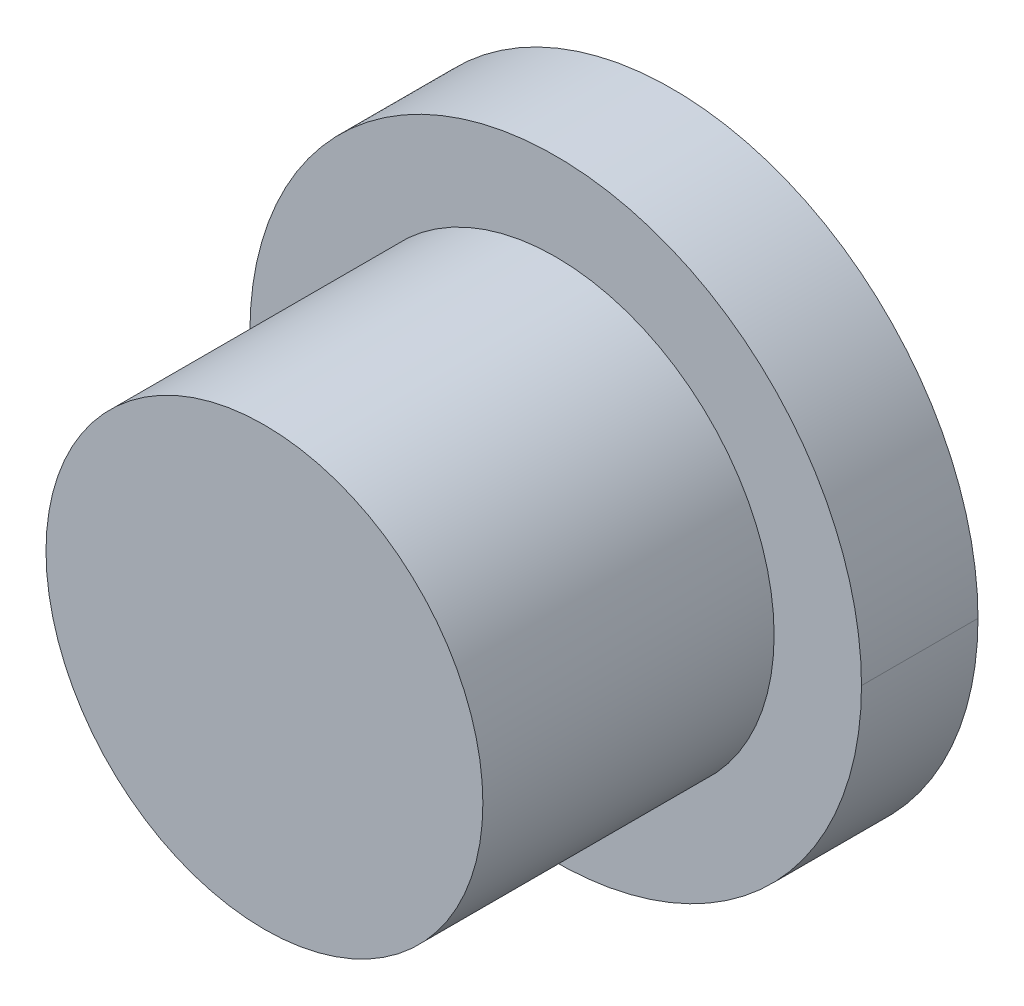
ISO-10303-21;
HEADER;
FILE_DESCRIPTION(('STEP AP214'),'2;1');
FILE_NAME('part.step','',(''),(''),'','','');
FILE_SCHEMA(('AUTOMOTIVE_DESIGN { 1 0 10303 214 1 1 1 1 }'));
ENDSEC;
DATA;
#1=APPLICATION_CONTEXT('core data for automotive mechanical design processes');
#2=APPLICATION_PROTOCOL_DEFINITION('international standard','automotive_design',2000,#1);
#3=PRODUCT_CONTEXT('',#1,'mechanical');
#4=PRODUCT('Part','Part','',(#3));
#5=PRODUCT_RELATED_PRODUCT_CATEGORY('part','',(#4));
#6=PRODUCT_DEFINITION_FORMATION('','',#4);
#7=PRODUCT_DEFINITION_CONTEXT('part definition',#1,'design');
#8=PRODUCT_DEFINITION('design','',#6,#7);
#9=PRODUCT_DEFINITION_SHAPE('','',#8);
#10=(LENGTH_UNIT() NAMED_UNIT(*) SI_UNIT(.MILLI.,.METRE.));
#11=(NAMED_UNIT(*) PLANE_ANGLE_UNIT() SI_UNIT($,.RADIAN.));
#12=(NAMED_UNIT(*) SI_UNIT($,.STERADIAN.) SOLID_ANGLE_UNIT());
#13=UNCERTAINTY_MEASURE_WITH_UNIT(LENGTH_MEASURE(1.E-05),#10,'distance_accuracy_value','');
#14=(GEOMETRIC_REPRESENTATION_CONTEXT(3) GLOBAL_UNCERTAINTY_ASSIGNED_CONTEXT((#13)) GLOBAL_UNIT_ASSIGNED_CONTEXT((#10,
#11,#12)) REPRESENTATION_CONTEXT('',''));
#15=CARTESIAN_POINT('',(0.,0.,0.));
#16=DIRECTION('',(0.,0.,1.));
#17=DIRECTION('',(1.,0.,0.));
#18=AXIS2_PLACEMENT_3D('',#15,#16,#17);
#19=CARTESIAN_POINT('',(0.,0.,-4.));
#20=DIRECTION('',(0.,0.,1.));
#21=DIRECTION('',(1.,0.,0.));
#22=AXIS2_PLACEMENT_3D('',#19,#20,#21);
#23=CYLINDRICAL_SURFACE('',#22,10.5);
#24=CARTESIAN_POINT('',(0.,0.,-4.));
#25=DIRECTION('',(0.,0.,-1.));
#26=DIRECTION('',(-1.,0.,0.));
#27=AXIS2_PLACEMENT_3D('',#24,#25,#26);
#28=CIRCLE('',#27,10.5);
#29=CARTESIAN_POINT('',(-10.5,0.,-4.));
#30=VERTEX_POINT('',#29);
#31=CARTESIAN_POINT('',(10.5,0.,-4.));
#32=VERTEX_POINT('',#31);
#33=EDGE_CURVE('E75',#30,#32,#28,.T.);
#34=ORIENTED_EDGE('',*,*,#33,.F.);
#35=DIRECTION('',(0.,0.,1.));
#36=VECTOR('',#35,1.);
#37=CARTESIAN_POINT('',(-10.5,0.,-4.));
#38=LINE('',#37,#36);
#39=CARTESIAN_POINT('',(-10.5,0.,0.));
#40=VERTEX_POINT('',#39);
#41=EDGE_CURVE('E11',#30,#40,#38,.T.);
#42=ORIENTED_EDGE('',*,*,#41,.T.);
#43=CARTESIAN_POINT('',(0.,0.,0.));
#44=DIRECTION('',(0.,0.,-1.));
#45=DIRECTION('',(-1.,0.,0.));
#46=AXIS2_PLACEMENT_3D('',#43,#44,#45);
#47=CIRCLE('',#46,10.5);
#48=CARTESIAN_POINT('',(10.5,0.,0.));
#49=VERTEX_POINT('',#48);
#50=EDGE_CURVE('E62',#40,#49,#47,.T.);
#51=ORIENTED_EDGE('',*,*,#50,.T.);
#52=DIRECTION('',(0.,0.,1.));
#53=VECTOR('',#52,1.);
#54=CARTESIAN_POINT('',(10.5,0.,-4.));
#55=LINE('',#54,#53);
#56=EDGE_CURVE('E118',#32,#49,#55,.T.);
#57=ORIENTED_EDGE('',*,*,#56,.F.);
#58=EDGE_LOOP('',(#34,#42,#51,#57));
#59=FACE_BOUND('',#58,.T.);
#60=ADVANCED_FACE('F51',(#59),#23,.T.);
#61=CARTESIAN_POINT('',(0.,0.,5.));
#62=DIRECTION('',(0.,0.,-1.));
#63=DIRECTION('',(-1.,0.,0.));
#64=AXIS2_PLACEMENT_3D('',#61,#62,#63);
#65=CYLINDRICAL_SURFACE('',#64,7.5);
#66=DIRECTION('',(0.,0.,-1.));
#67=VECTOR('',#66,1.);
#68=CARTESIAN_POINT('',(-7.5,0.,5.));
#69=LINE('',#68,#67);
#70=CARTESIAN_POINT('',(-7.5,0.,5.));
#71=VERTEX_POINT('',#70);
#72=CARTESIAN_POINT('',(-7.5,0.,0.));
#73=VERTEX_POINT('',#72);
#74=EDGE_CURVE('E112',#71,#73,#69,.T.);
#75=ORIENTED_EDGE('',*,*,#74,.F.);
#76=ORIENTED_EDGE('',*,*,#74,.T.);
#77=CARTESIAN_POINT('',(0.,0.,0.));
#78=DIRECTION('',(0.,0.,1.));
#79=DIRECTION('',(1.,0.,0.));
#80=AXIS2_PLACEMENT_3D('',#77,#78,#79);
#81=CIRCLE('',#80,7.5);
#82=CARTESIAN_POINT('',(7.5,0.,0.));
#83=VERTEX_POINT('',#82);
#84=EDGE_CURVE('E109',#73,#83,#81,.T.);
#85=ORIENTED_EDGE('',*,*,#84,.T.);
#86=DIRECTION('',(0.,0.,-1.));
#87=VECTOR('',#86,1.);
#88=CARTESIAN_POINT('',(7.5,0.,5.));
#89=LINE('',#88,#87);
#90=CARTESIAN_POINT('',(7.5,0.,5.));
#91=VERTEX_POINT('',#90);
#92=EDGE_CURVE('E99',#91,#83,#89,.T.);
#93=ORIENTED_EDGE('',*,*,#92,.F.);
#94=ORIENTED_EDGE('',*,*,#92,.T.);
#95=CARTESIAN_POINT('',(0.,0.,0.));
#96=DIRECTION('',(0.,0.,1.));
#97=DIRECTION('',(1.,0.,0.));
#98=AXIS2_PLACEMENT_3D('',#95,#96,#97);
#99=CIRCLE('',#98,7.5);
#100=EDGE_CURVE('E107',#83,#73,#99,.T.);
#101=ORIENTED_EDGE('',*,*,#100,.T.);
#102=EDGE_LOOP('',(#75,#76,#85,#93,#94,#101));
#103=FACE_BOUND('',#102,.T.);
#104=CARTESIAN_POINT('',(0.,0.,10.));
#105=DIRECTION('',(0.,0.,1.));
#106=DIRECTION('',(1.,0.,0.));
#107=AXIS2_PLACEMENT_3D('',#104,#105,#106);
#108=CIRCLE('',#107,7.5);
#109=CARTESIAN_POINT('',(7.5,0.,10.));
#110=VERTEX_POINT('',#109);
#111=EDGE_CURVE('E192',#110,#110,#108,.T.);
#112=ORIENTED_EDGE('',*,*,#111,.F.);
#113=EDGE_LOOP('',(#112));
#114=FACE_BOUND('',#113,.T.);
#115=ADVANCED_FACE('F114',(#103,#114),#65,.T.);
#116=CARTESIAN_POINT('',(0.,0.,-4.));
#117=DIRECTION('',(0.,0.,1.));
#118=DIRECTION('',(1.,0.,0.));
#119=AXIS2_PLACEMENT_3D('',#116,#117,#118);
#120=CYLINDRICAL_SURFACE('',#119,10.5);
#121=ORIENTED_EDGE('',*,*,#41,.F.);
#122=CARTESIAN_POINT('',(0.,0.,-4.));
#123=DIRECTION('',(0.,0.,-1.));
#124=DIRECTION('',(-1.,0.,0.));
#125=AXIS2_PLACEMENT_3D('',#122,#123,#124);
#126=CIRCLE('',#125,10.5);
#127=EDGE_CURVE('E128',#32,#30,#126,.T.);
#128=ORIENTED_EDGE('',*,*,#127,.F.);
#129=ORIENTED_EDGE('',*,*,#56,.T.);
#130=CARTESIAN_POINT('',(0.,0.,0.));
#131=DIRECTION('',(0.,0.,-1.));
#132=DIRECTION('',(-1.,0.,0.));
#133=AXIS2_PLACEMENT_3D('',#130,#131,#132);
#134=CIRCLE('',#133,10.5);
#135=EDGE_CURVE('E124',#49,#40,#134,.T.);
#136=ORIENTED_EDGE('',*,*,#135,.T.);
#137=EDGE_LOOP('',(#121,#128,#129,#136));
#138=FACE_BOUND('',#137,.T.);
#139=ADVANCED_FACE('F159',(#138),#120,.T.);
#140=CARTESIAN_POINT('',(0.,0.,-4.));
#141=DIRECTION('',(0.,0.,-1.));
#142=DIRECTION('',(0.,-1.,0.));
#143=AXIS2_PLACEMENT_3D('',#140,#141,#142);
#144=PLANE('',#143);
#145=CARTESIAN_POINT('',(0.,0.,-4.));
#146=DIRECTION('',(0.,0.,-1.));
#147=DIRECTION('',(0.,1.,0.));
#148=AXIS2_PLACEMENT_3D('',#145,#146,#147);
#149=CIRCLE('',#148,9.25);
#150=CARTESIAN_POINT('',(0.,9.25,-4.));
#151=VERTEX_POINT('',#150);
#152=EDGE_CURVE('E149',#151,#151,#149,.T.);
#153=ORIENTED_EDGE('',*,*,#152,.F.);
#154=EDGE_LOOP('',(#153));
#155=FACE_BOUND('',#154,.T.);
#156=ORIENTED_EDGE('',*,*,#127,.T.);
#157=ORIENTED_EDGE('',*,*,#33,.T.);
#158=EDGE_LOOP('',(#156,#157));
#159=FACE_BOUND('',#158,.T.);
#160=ADVANCED_FACE('F160',(#155,#159),#144,.T.);
#161=CARTESIAN_POINT('',(0.,0.,0.));
#162=DIRECTION('',(0.,0.,-1.));
#163=DIRECTION('',(0.,-1.,0.));
#164=AXIS2_PLACEMENT_3D('',#161,#162,#163);
#165=PLANE('',#164);
#166=ORIENTED_EDGE('',*,*,#135,.F.);
#167=ORIENTED_EDGE('',*,*,#50,.F.);
#168=EDGE_LOOP('',(#166,#167));
#169=FACE_BOUND('',#168,.T.);
#170=ORIENTED_EDGE('',*,*,#84,.F.);
#171=ORIENTED_EDGE('',*,*,#100,.F.);
#172=EDGE_LOOP('',(#170,#171));
#173=FACE_BOUND('',#172,.T.);
#174=ADVANCED_FACE('F108',(#169,#173),#165,.F.);
#175=CARTESIAN_POINT('',(0.,0.,-4.));
#176=DIRECTION('',(0.,0.,-1.));
#177=DIRECTION('',(0.,1.,0.));
#178=AXIS2_PLACEMENT_3D('',#175,#176,#177);
#179=CONICAL_SURFACE('',#178,9.25,0.785398163397449);
#180=CARTESIAN_POINT('',(0.,0.,-3.25));
#181=DIRECTION('',(0.,0.,-1.));
#182=DIRECTION('',(0.,1.,0.));
#183=AXIS2_PLACEMENT_3D('',#180,#181,#182);
#184=CIRCLE('',#183,8.5);
#185=CARTESIAN_POINT('',(0.,8.5,-3.25));
#186=VERTEX_POINT('',#185);
#187=EDGE_CURVE('E143',#186,#186,#184,.T.);
#188=ORIENTED_EDGE('',*,*,#187,.F.);
#189=EDGE_LOOP('',(#188));
#190=FACE_BOUND('',#189,.T.);
#191=ORIENTED_EDGE('',*,*,#152,.T.);
#192=EDGE_LOOP('',(#191));
#193=FACE_BOUND('',#192,.T.);
#194=ADVANCED_FACE('F167',(#190,#193),#179,.F.);
#195=CARTESIAN_POINT('',(0.,0.,-1.));
#196=DIRECTION('',(0.,0.,-1.));
#197=DIRECTION('',(0.,-1.,0.));
#198=AXIS2_PLACEMENT_3D('',#195,#196,#197);
#199=PLANE('',#198);
#200=CARTESIAN_POINT('',(0.,0.,-1.));
#201=DIRECTION('',(0.,0.,-1.));
#202=DIRECTION('',(-1.,0.,0.));
#203=AXIS2_PLACEMENT_3D('',#200,#201,#202);
#204=CIRCLE('',#203,8.5);
#205=CARTESIAN_POINT('',(-8.5,0.,-1.));
#206=VERTEX_POINT('',#205);
#207=EDGE_CURVE('E136',#206,#206,#204,.T.);
#208=ORIENTED_EDGE('',*,*,#207,.T.);
#209=EDGE_LOOP('',(#208));
#210=FACE_BOUND('',#209,.T.);
#211=ADVANCED_FACE('F53',(#210),#199,.T.);
#212=CARTESIAN_POINT('',(0.,0.,-1.));
#213=DIRECTION('',(0.,0.,-1.));
#214=DIRECTION('',(-1.,0.,0.));
#215=AXIS2_PLACEMENT_3D('',#212,#213,#214);
#216=CYLINDRICAL_SURFACE('',#215,8.5);
#217=ORIENTED_EDGE('',*,*,#187,.T.);
#218=EDGE_LOOP('',(#217));
#219=FACE_BOUND('',#218,.T.);
#220=ORIENTED_EDGE('',*,*,#207,.F.);
#221=EDGE_LOOP('',(#220));
#222=FACE_BOUND('',#221,.T.);
#223=ADVANCED_FACE('F178',(#219,#222),#216,.F.);
#224=CARTESIAN_POINT('',(0.,0.,10.));
#225=DIRECTION('',(0.,0.,1.));
#226=DIRECTION('',(1.,0.,0.));
#227=AXIS2_PLACEMENT_3D('',#224,#225,#226);
#228=PLANE('',#227);
#229=ORIENTED_EDGE('',*,*,#111,.T.);
#230=EDGE_LOOP('',(#229));
#231=FACE_BOUND('',#230,.T.);
#232=ADVANCED_FACE('F181',(#231),#228,.T.);
#233=CLOSED_SHELL('',(#60,#115,#139,#160,#174,#194,#211,#223,#232));
#234=MANIFOLD_SOLID_BREP('B2',#233);
#235=ADVANCED_BREP_SHAPE_REPRESENTATION('',(#18,#234),#14);
#236=SHAPE_DEFINITION_REPRESENTATION(#9,#235);
ENDSEC;
END-ISO-10303-21;
